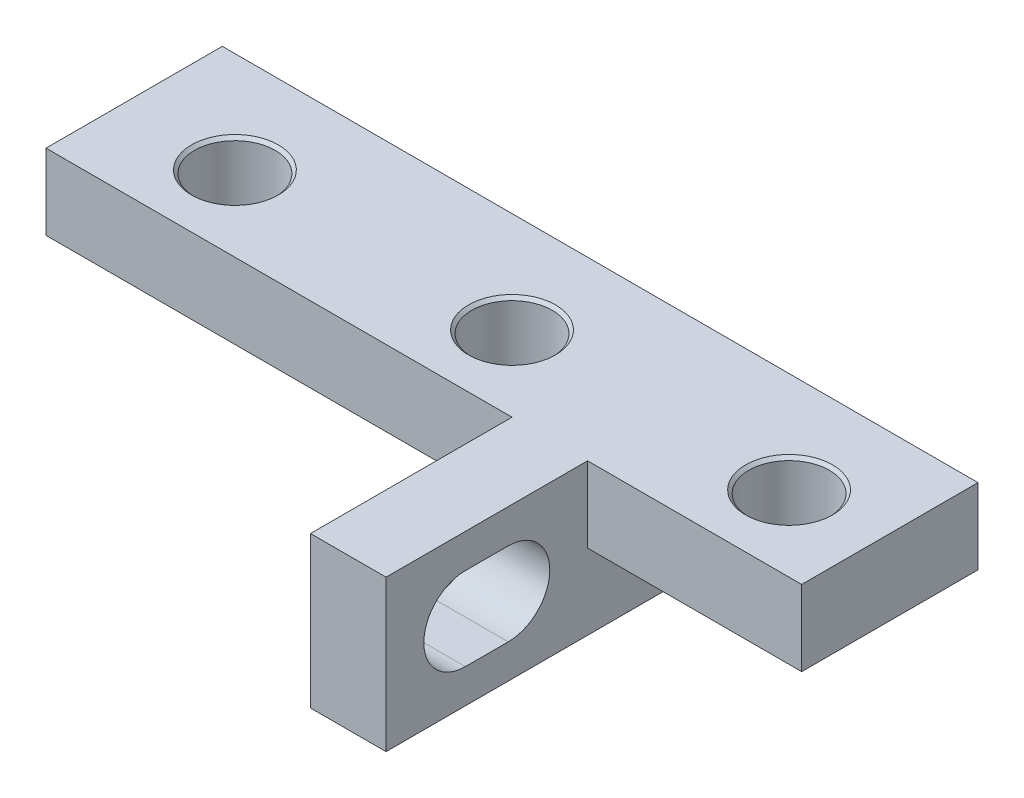
ISO-10303-21;
HEADER;
FILE_DESCRIPTION(('STEP AP214'),'2;1');
FILE_NAME('part.step','',(''),(''),'','','');
FILE_SCHEMA(('AUTOMOTIVE_DESIGN { 1 0 10303 214 1 1 1 1 }'));
ENDSEC;
DATA;
#1=APPLICATION_CONTEXT('core data for automotive mechanical design processes');
#2=APPLICATION_PROTOCOL_DEFINITION('international standard','automotive_design',2000,#1);
#3=PRODUCT_CONTEXT('',#1,'mechanical');
#4=PRODUCT('Part','Part','',(#3));
#5=PRODUCT_RELATED_PRODUCT_CATEGORY('part','',(#4));
#6=PRODUCT_DEFINITION_FORMATION('','',#4);
#7=PRODUCT_DEFINITION_CONTEXT('part definition',#1,'design');
#8=PRODUCT_DEFINITION('design','',#6,#7);
#9=PRODUCT_DEFINITION_SHAPE('','',#8);
#10=(LENGTH_UNIT() NAMED_UNIT(*) SI_UNIT(.MILLI.,.METRE.));
#11=(NAMED_UNIT(*) PLANE_ANGLE_UNIT() SI_UNIT($,.RADIAN.));
#12=(NAMED_UNIT(*) SI_UNIT($,.STERADIAN.) SOLID_ANGLE_UNIT());
#13=UNCERTAINTY_MEASURE_WITH_UNIT(LENGTH_MEASURE(1.E-05),#10,'distance_accuracy_value','');
#14=(GEOMETRIC_REPRESENTATION_CONTEXT(3) GLOBAL_UNCERTAINTY_ASSIGNED_CONTEXT((#13)) GLOBAL_UNIT_ASSIGNED_CONTEXT((#10,
#11,#12)) REPRESENTATION_CONTEXT('',''));
#15=CARTESIAN_POINT('',(0.,0.,0.));
#16=DIRECTION('',(0.,0.,1.));
#17=DIRECTION('',(1.,0.,0.));
#18=AXIS2_PLACEMENT_3D('',#15,#16,#17);
#19=CARTESIAN_POINT('',(-1.5,0.,15.));
#20=DIRECTION('',(0.,0.,-1.));
#21=DIRECTION('',(-1.,0.,0.));
#22=AXIS2_PLACEMENT_3D('',#19,#20,#21);
#23=PLANE('',#22);
#24=DIRECTION('',(0.,1.,0.));
#25=VECTOR('',#24,1.);
#26=CARTESIAN_POINT('',(1.5,22.,15.));
#27=LINE('',#26,#25);
#28=CARTESIAN_POINT('',(1.5,19.,15.));
#29=VERTEX_POINT('',#28);
#30=CARTESIAN_POINT('',(1.5,25.,15.));
#31=VERTEX_POINT('',#30);
#32=EDGE_CURVE('E249',#29,#31,#27,.T.);
#33=ORIENTED_EDGE('',*,*,#32,.T.);
#34=DIRECTION('',(-1.,0.,0.));
#35=VECTOR('',#34,1.);
#36=CARTESIAN_POINT('',(-20.,25.,15.));
#37=LINE('',#36,#35);
#38=CARTESIAN_POINT('',(-1.5,25.,15.));
#39=VERTEX_POINT('',#38);
#40=EDGE_CURVE('E251',#31,#39,#37,.T.);
#41=ORIENTED_EDGE('',*,*,#40,.T.);
#42=DIRECTION('',(0.,-1.,0.));
#43=VECTOR('',#42,1.);
#44=CARTESIAN_POINT('',(-1.5,0.,15.));
#45=LINE('',#44,#43);
#46=CARTESIAN_POINT('',(-1.5,19.,15.));
#47=VERTEX_POINT('',#46);
#48=EDGE_CURVE('E254',#39,#47,#45,.T.);
#49=ORIENTED_EDGE('',*,*,#48,.T.);
#50=DIRECTION('',(1.,0.,0.));
#51=VECTOR('',#50,1.);
#52=CARTESIAN_POINT('',(-2.24646963588495,19.,15.));
#53=LINE('',#52,#51);
#54=EDGE_CURVE('E236',#47,#29,#53,.T.);
#55=ORIENTED_EDGE('',*,*,#54,.T.);
#56=EDGE_LOOP('',(#33,#41,#49,#55));
#57=FACE_BOUND('',#56,.T.);
#58=ADVANCED_FACE('F34',(#57),#23,.F.);
#59=CARTESIAN_POINT('',(-1.5,0.,0.));
#60=DIRECTION('',(0.,0.,-1.));
#61=DIRECTION('',(-1.,0.,0.));
#62=AXIS2_PLACEMENT_3D('',#59,#60,#61);
#63=PLANE('',#62);
#64=DIRECTION('',(-1.,0.,0.));
#65=VECTOR('',#64,1.);
#66=CARTESIAN_POINT('',(-20.,25.,0.));
#67=LINE('',#66,#65);
#68=CARTESIAN_POINT('',(10.,25.,0.));
#69=VERTEX_POINT('',#68);
#70=CARTESIAN_POINT('',(-20.,25.,0.));
#71=VERTEX_POINT('',#70);
#72=EDGE_CURVE('E263',#69,#71,#67,.T.);
#73=ORIENTED_EDGE('',*,*,#72,.F.);
#74=DIRECTION('',(0.,1.,0.));
#75=VECTOR('',#74,1.);
#76=CARTESIAN_POINT('',(10.,-16.231303942556,0.));
#77=LINE('',#76,#75);
#78=CARTESIAN_POINT('',(10.,22.,0.));
#79=VERTEX_POINT('',#78);
#80=EDGE_CURVE('E224',#79,#69,#77,.T.);
#81=ORIENTED_EDGE('',*,*,#80,.F.);
#82=DIRECTION('',(1.,0.,0.));
#83=VECTOR('',#82,1.);
#84=CARTESIAN_POINT('',(20.,22.,0.));
#85=LINE('',#84,#83);
#86=CARTESIAN_POINT('',(1.5,22.,0.));
#87=VERTEX_POINT('',#86);
#88=EDGE_CURVE('E260',#87,#79,#85,.T.);
#89=ORIENTED_EDGE('',*,*,#88,.F.);
#90=DIRECTION('',(0.,1.,0.));
#91=VECTOR('',#90,1.);
#92=CARTESIAN_POINT('',(1.5,22.,0.));
#93=LINE('',#92,#91);
#94=CARTESIAN_POINT('',(1.5,19.,0.));
#95=VERTEX_POINT('',#94);
#96=EDGE_CURVE('E246',#95,#87,#93,.T.);
#97=ORIENTED_EDGE('',*,*,#96,.F.);
#98=DIRECTION('',(1.,0.,0.));
#99=VECTOR('',#98,1.);
#100=CARTESIAN_POINT('',(-2.24646963588495,19.,0.));
#101=LINE('',#100,#99);
#102=CARTESIAN_POINT('',(-1.5,19.,0.));
#103=VERTEX_POINT('',#102);
#104=EDGE_CURVE('E239',#103,#95,#101,.T.);
#105=ORIENTED_EDGE('',*,*,#104,.F.);
#106=DIRECTION('',(0.,-1.,0.));
#107=VECTOR('',#106,1.);
#108=CARTESIAN_POINT('',(-1.5,0.,0.));
#109=LINE('',#108,#107);
#110=CARTESIAN_POINT('',(-1.5,22.,0.));
#111=VERTEX_POINT('',#110);
#112=EDGE_CURVE('E252',#111,#103,#109,.T.);
#113=ORIENTED_EDGE('',*,*,#112,.F.);
#114=DIRECTION('',(1.,0.,0.));
#115=VECTOR('',#114,1.);
#116=CARTESIAN_POINT('',(-1.5,22.,0.));
#117=LINE('',#116,#115);
#118=CARTESIAN_POINT('',(-20.,22.,0.));
#119=VERTEX_POINT('',#118);
#120=EDGE_CURVE('E269',#119,#111,#117,.T.);
#121=ORIENTED_EDGE('',*,*,#120,.F.);
#122=DIRECTION('',(0.,-1.,0.));
#123=VECTOR('',#122,1.);
#124=CARTESIAN_POINT('',(-20.,22.,0.));
#125=LINE('',#124,#123);
#126=EDGE_CURVE('E266',#71,#119,#125,.T.);
#127=ORIENTED_EDGE('',*,*,#126,.F.);
#128=EDGE_LOOP('',(#73,#81,#89,#97,#105,#113,#121,#127));
#129=FACE_BOUND('',#128,.T.);
#130=ADVANCED_FACE('F292',(#129),#63,.T.);
#131=CARTESIAN_POINT('',(20.,22.,15.));
#132=DIRECTION('',(0.,1.,0.));
#133=DIRECTION('',(-1.,0.,0.));
#134=AXIS2_PLACEMENT_3D('',#131,#132,#133);
#135=PLANE('',#134);
#136=CARTESIAN_POINT('',(6.5,22.,4.));
#137=DIRECTION('',(0.,-1.,0.));
#138=DIRECTION('',(0.,0.,-1.));
#139=AXIS2_PLACEMENT_3D('',#136,#137,#138);
#140=CIRCLE('',#139,1.725);
#141=CARTESIAN_POINT('',(6.5,22.,2.275));
#142=VERTEX_POINT('',#141);
#143=EDGE_CURVE('E185',#142,#142,#140,.T.);
#144=ORIENTED_EDGE('',*,*,#143,.F.);
#145=EDGE_LOOP('',(#144));
#146=FACE_BOUND('',#145,.T.);
#147=DIRECTION('',(0.,0.,1.));
#148=VECTOR('',#147,1.);
#149=CARTESIAN_POINT('',(10.,22.,0.));
#150=LINE('',#149,#148);
#151=CARTESIAN_POINT('',(10.,22.,7.));
#152=VERTEX_POINT('',#151);
#153=EDGE_CURVE('E232',#79,#152,#150,.T.);
#154=ORIENTED_EDGE('',*,*,#153,.T.);
#155=DIRECTION('',(1.,0.,0.));
#156=VECTOR('',#155,1.);
#157=CARTESIAN_POINT('',(-5.,22.,7.));
#158=LINE('',#157,#156);
#159=CARTESIAN_POINT('',(1.5,22.,7.));
#160=VERTEX_POINT('',#159);
#161=EDGE_CURVE('E207',#160,#152,#158,.T.);
#162=ORIENTED_EDGE('',*,*,#161,.F.);
#163=DIRECTION('',(0.,0.,-1.));
#164=VECTOR('',#163,1.);
#165=CARTESIAN_POINT('',(1.5,22.,15.));
#166=LINE('',#165,#164);
#167=EDGE_CURVE('E12',#160,#87,#166,.T.);
#168=ORIENTED_EDGE('',*,*,#167,.T.);
#169=ORIENTED_EDGE('',*,*,#88,.T.);
#170=EDGE_LOOP('',(#154,#162,#168,#169));
#171=FACE_BOUND('',#170,.T.);
#172=ADVANCED_FACE('F318',(#146,#171),#135,.F.);
#173=CARTESIAN_POINT('',(-20.,25.,15.));
#174=DIRECTION('',(0.,-1.,0.));
#175=DIRECTION('',(0.,0.,-1.));
#176=AXIS2_PLACEMENT_3D('',#173,#174,#175);
#177=PLANE('',#176);
#178=CARTESIAN_POINT('',(-15.5,25.,4.));
#179=DIRECTION('',(0.,-1.,0.));
#180=DIRECTION('',(0.,0.,-1.));
#181=AXIS2_PLACEMENT_3D('',#178,#179,#180);
#182=CIRCLE('',#181,1.725);
#183=CARTESIAN_POINT('',(-15.5,25.,2.275));
#184=VERTEX_POINT('',#183);
#185=EDGE_CURVE('E148',#184,#184,#182,.T.);
#186=ORIENTED_EDGE('',*,*,#185,.T.);
#187=EDGE_LOOP('',(#186));
#188=FACE_BOUND('',#187,.T.);
#189=CARTESIAN_POINT('',(6.5,25.,4.));
#190=DIRECTION('',(0.,-1.,0.));
#191=DIRECTION('',(0.,0.,-1.));
#192=AXIS2_PLACEMENT_3D('',#189,#190,#191);
#193=CIRCLE('',#192,1.725);
#194=CARTESIAN_POINT('',(6.5,25.,2.275));
#195=VERTEX_POINT('',#194);
#196=EDGE_CURVE('E182',#195,#195,#193,.T.);
#197=ORIENTED_EDGE('',*,*,#196,.T.);
#198=EDGE_LOOP('',(#197));
#199=FACE_BOUND('',#198,.T.);
#200=CARTESIAN_POINT('',(-4.5,25.,4.));
#201=DIRECTION('',(0.,-1.,0.));
#202=DIRECTION('',(0.,0.,-1.));
#203=AXIS2_PLACEMENT_3D('',#200,#201,#202);
#204=CIRCLE('',#203,1.725);
#205=CARTESIAN_POINT('',(-4.5,25.,2.275));
#206=VERTEX_POINT('',#205);
#207=EDGE_CURVE('E194',#206,#206,#204,.T.);
#208=ORIENTED_EDGE('',*,*,#207,.T.);
#209=EDGE_LOOP('',(#208));
#210=FACE_BOUND('',#209,.T.);
#211=DIRECTION('',(0.,0.,1.));
#212=VECTOR('',#211,1.);
#213=CARTESIAN_POINT('',(1.5,25.,-18.7416648139913));
#214=LINE('',#213,#212);
#215=CARTESIAN_POINT('',(1.5,25.,7.));
#216=VERTEX_POINT('',#215);
#217=EDGE_CURVE('E214',#216,#31,#214,.T.);
#218=ORIENTED_EDGE('',*,*,#217,.F.);
#219=DIRECTION('',(-1.,0.,0.));
#220=VECTOR('',#219,1.);
#221=CARTESIAN_POINT('',(-5.,25.,7.));
#222=LINE('',#221,#220);
#223=CARTESIAN_POINT('',(10.,25.,7.));
#224=VERTEX_POINT('',#223);
#225=EDGE_CURVE('E211',#224,#216,#222,.T.);
#226=ORIENTED_EDGE('',*,*,#225,.F.);
#227=DIRECTION('',(0.,0.,1.));
#228=VECTOR('',#227,1.);
#229=CARTESIAN_POINT('',(10.,25.,0.));
#230=LINE('',#229,#228);
#231=EDGE_CURVE('E233',#69,#224,#230,.T.);
#232=ORIENTED_EDGE('',*,*,#231,.F.);
#233=ORIENTED_EDGE('',*,*,#72,.T.);
#234=DIRECTION('',(0.,0.,-1.));
#235=VECTOR('',#234,1.);
#236=CARTESIAN_POINT('',(-20.,25.,15.));
#237=LINE('',#236,#235);
#238=CARTESIAN_POINT('',(-20.,25.,7.));
#239=VERTEX_POINT('',#238);
#240=EDGE_CURVE('E42',#239,#71,#237,.T.);
#241=ORIENTED_EDGE('',*,*,#240,.F.);
#242=DIRECTION('',(-1.,0.,0.));
#243=VECTOR('',#242,1.);
#244=CARTESIAN_POINT('',(-5.,25.,7.));
#245=LINE('',#244,#243);
#246=CARTESIAN_POINT('',(-1.5,25.,7.));
#247=VERTEX_POINT('',#246);
#248=EDGE_CURVE('E227',#247,#239,#245,.T.);
#249=ORIENTED_EDGE('',*,*,#248,.F.);
#250=DIRECTION('',(0.,0.,1.));
#251=VECTOR('',#250,1.);
#252=CARTESIAN_POINT('',(-1.5,25.,-18.7416648139913));
#253=LINE('',#252,#251);
#254=EDGE_CURVE('E221',#247,#39,#253,.T.);
#255=ORIENTED_EDGE('',*,*,#254,.T.);
#256=ORIENTED_EDGE('',*,*,#40,.F.);
#257=EDGE_LOOP('',(#218,#226,#232,#233,#241,#249,#255,#256));
#258=FACE_BOUND('',#257,.T.);
#259=ADVANCED_FACE('F288',(#188,#199,#210,#258),#177,.F.);
#260=CARTESIAN_POINT('',(1.5,22.,15.));
#261=DIRECTION('',(-1.,0.,0.));
#262=DIRECTION('',(0.,-1.,0.));
#263=AXIS2_PLACEMENT_3D('',#260,#261,#262);
#264=PLANE('',#263);
#265=DIRECTION('',(0.,0.,-1.));
#266=VECTOR('',#265,1.);
#267=CARTESIAN_POINT('',(1.5,20.35,11.85));
#268=LINE('',#267,#266);
#269=CARTESIAN_POINT('',(1.5,20.35,11.85));
#270=VERTEX_POINT('',#269);
#271=CARTESIAN_POINT('',(1.5,20.35,10.15));
#272=VERTEX_POINT('',#271);
#273=EDGE_CURVE('E156',#270,#272,#268,.T.);
#274=ORIENTED_EDGE('',*,*,#273,.F.);
#275=CARTESIAN_POINT('',(1.5,22.,11.85));
#276=DIRECTION('',(1.,0.,0.));
#277=DIRECTION('',(0.,1.,0.));
#278=AXIS2_PLACEMENT_3D('',#275,#276,#277);
#279=CIRCLE('',#278,1.65);
#280=CARTESIAN_POINT('',(1.5,23.65,11.85));
#281=VERTEX_POINT('',#280);
#282=EDGE_CURVE('E49',#281,#270,#279,.T.);
#283=ORIENTED_EDGE('',*,*,#282,.F.);
#284=DIRECTION('',(0.,0.,1.));
#285=VECTOR('',#284,1.);
#286=CARTESIAN_POINT('',(1.5,23.65,11.85));
#287=LINE('',#286,#285);
#288=CARTESIAN_POINT('',(1.5,23.65,10.15));
#289=VERTEX_POINT('',#288);
#290=EDGE_CURVE('E142',#289,#281,#287,.T.);
#291=ORIENTED_EDGE('',*,*,#290,.F.);
#292=CARTESIAN_POINT('',(1.5,22.,10.15));
#293=DIRECTION('',(1.,0.,0.));
#294=DIRECTION('',(0.,1.,0.));
#295=AXIS2_PLACEMENT_3D('',#292,#293,#294);
#296=CIRCLE('',#295,1.65);
#297=EDGE_CURVE('E162',#272,#289,#296,.T.);
#298=ORIENTED_EDGE('',*,*,#297,.F.);
#299=EDGE_LOOP('',(#274,#283,#291,#298));
#300=FACE_BOUND('',#299,.T.);
#301=DIRECTION('',(0.,0.,1.));
#302=VECTOR('',#301,1.);
#303=CARTESIAN_POINT('',(1.5,19.,0.));
#304=LINE('',#303,#302);
#305=EDGE_CURVE('E244',#95,#29,#304,.T.);
#306=ORIENTED_EDGE('',*,*,#305,.F.);
#307=ORIENTED_EDGE('',*,*,#96,.T.);
#308=ORIENTED_EDGE('',*,*,#167,.F.);
#309=DIRECTION('',(0.,1.,0.));
#310=VECTOR('',#309,1.);
#311=CARTESIAN_POINT('',(1.5,-1.93805977429964,7.));
#312=LINE('',#311,#310);
#313=EDGE_CURVE('E206',#160,#216,#312,.T.);
#314=ORIENTED_EDGE('',*,*,#313,.T.);
#315=ORIENTED_EDGE('',*,*,#217,.T.);
#316=ORIENTED_EDGE('',*,*,#32,.F.);
#317=EDGE_LOOP('',(#306,#307,#308,#314,#315,#316));
#318=FACE_BOUND('',#317,.T.);
#319=ADVANCED_FACE('F36',(#300,#318),#264,.F.);
#320=CARTESIAN_POINT('',(-1.5,0.,15.));
#321=DIRECTION('',(1.,0.,0.));
#322=DIRECTION('',(0.,1.,0.));
#323=AXIS2_PLACEMENT_3D('',#320,#321,#322);
#324=PLANE('',#323);
#325=DIRECTION('',(0.,0.,-1.));
#326=VECTOR('',#325,1.);
#327=CARTESIAN_POINT('',(-1.5,23.65,11.85));
#328=LINE('',#327,#326);
#329=CARTESIAN_POINT('',(-1.5,23.65,11.85));
#330=VERTEX_POINT('',#329);
#331=CARTESIAN_POINT('',(-1.5,23.65,10.15));
#332=VERTEX_POINT('',#331);
#333=EDGE_CURVE('E154',#330,#332,#328,.T.);
#334=ORIENTED_EDGE('',*,*,#333,.F.);
#335=CARTESIAN_POINT('',(-1.5,22.,11.85));
#336=DIRECTION('',(1.,0.,0.));
#337=DIRECTION('',(0.,1.,0.));
#338=AXIS2_PLACEMENT_3D('',#335,#336,#337);
#339=CIRCLE('',#338,1.65);
#340=CARTESIAN_POINT('',(-1.5,20.35,11.85));
#341=VERTEX_POINT('',#340);
#342=EDGE_CURVE('E136',#341,#330,#339,.F.);
#343=ORIENTED_EDGE('',*,*,#342,.F.);
#344=DIRECTION('',(0.,0.,1.));
#345=VECTOR('',#344,1.);
#346=CARTESIAN_POINT('',(-1.5,20.35,11.85));
#347=LINE('',#346,#345);
#348=CARTESIAN_POINT('',(-1.5,20.35,10.15));
#349=VERTEX_POINT('',#348);
#350=EDGE_CURVE('E145',#349,#341,#347,.T.);
#351=ORIENTED_EDGE('',*,*,#350,.F.);
#352=CARTESIAN_POINT('',(-1.5,22.,10.15));
#353=DIRECTION('',(1.,0.,0.));
#354=DIRECTION('',(0.,1.,0.));
#355=AXIS2_PLACEMENT_3D('',#352,#353,#354);
#356=CIRCLE('',#355,1.65);
#357=EDGE_CURVE('E57',#332,#349,#356,.F.);
#358=ORIENTED_EDGE('',*,*,#357,.F.);
#359=EDGE_LOOP('',(#334,#343,#351,#358));
#360=FACE_BOUND('',#359,.T.);
#361=DIRECTION('',(0.,0.,1.));
#362=VECTOR('',#361,1.);
#363=CARTESIAN_POINT('',(-1.5,19.,0.));
#364=LINE('',#363,#362);
#365=EDGE_CURVE('E241',#103,#47,#364,.T.);
#366=ORIENTED_EDGE('',*,*,#365,.T.);
#367=ORIENTED_EDGE('',*,*,#48,.F.);
#368=ORIENTED_EDGE('',*,*,#254,.F.);
#369=DIRECTION('',(0.,1.,0.));
#370=VECTOR('',#369,1.);
#371=CARTESIAN_POINT('',(-1.5,-1.93805977429964,7.));
#372=LINE('',#371,#370);
#373=CARTESIAN_POINT('',(-1.5,22.,7.));
#374=VERTEX_POINT('',#373);
#375=EDGE_CURVE('E218',#374,#247,#372,.T.);
#376=ORIENTED_EDGE('',*,*,#375,.F.);
#377=DIRECTION('',(0.,0.,-1.));
#378=VECTOR('',#377,1.);
#379=CARTESIAN_POINT('',(-1.5,22.,15.));
#380=LINE('',#379,#378);
#381=EDGE_CURVE('E257',#374,#111,#380,.T.);
#382=ORIENTED_EDGE('',*,*,#381,.T.);
#383=ORIENTED_EDGE('',*,*,#112,.T.);
#384=EDGE_LOOP('',(#366,#367,#368,#376,#382,#383));
#385=FACE_BOUND('',#384,.T.);
#386=ADVANCED_FACE('F151',(#360,#385),#324,.F.);
#387=CARTESIAN_POINT('',(-20.,22.,15.));
#388=DIRECTION('',(1.,0.,0.));
#389=DIRECTION('',(0.,0.,-1.));
#390=AXIS2_PLACEMENT_3D('',#387,#388,#389);
#391=PLANE('',#390);
#392=DIRECTION('',(0.,0.,-1.));
#393=VECTOR('',#392,1.);
#394=CARTESIAN_POINT('',(-20.,22.,15.));
#395=LINE('',#394,#393);
#396=CARTESIAN_POINT('',(-20.,22.,7.));
#397=VERTEX_POINT('',#396);
#398=EDGE_CURVE('E275',#397,#119,#395,.T.);
#399=ORIENTED_EDGE('',*,*,#398,.F.);
#400=DIRECTION('',(0.,-1.,0.));
#401=VECTOR('',#400,1.);
#402=CARTESIAN_POINT('',(-20.,-1.93805977429964,7.));
#403=LINE('',#402,#401);
#404=EDGE_CURVE('E225',#239,#397,#403,.T.);
#405=ORIENTED_EDGE('',*,*,#404,.F.);
#406=ORIENTED_EDGE('',*,*,#240,.T.);
#407=ORIENTED_EDGE('',*,*,#126,.T.);
#408=EDGE_LOOP('',(#399,#405,#406,#407));
#409=FACE_BOUND('',#408,.T.);
#410=ADVANCED_FACE('F280',(#409),#391,.F.);
#411=CARTESIAN_POINT('',(-1.5,22.,15.));
#412=DIRECTION('',(0.,1.,0.));
#413=DIRECTION('',(-1.,0.,0.));
#414=AXIS2_PLACEMENT_3D('',#411,#412,#413);
#415=PLANE('',#414);
#416=CARTESIAN_POINT('',(-15.5,22.,4.));
#417=DIRECTION('',(0.,-1.,0.));
#418=DIRECTION('',(0.,0.,-1.));
#419=AXIS2_PLACEMENT_3D('',#416,#417,#418);
#420=CIRCLE('',#419,1.725);
#421=CARTESIAN_POINT('',(-15.5,22.,2.275));
#422=VERTEX_POINT('',#421);
#423=EDGE_CURVE('E173',#422,#422,#420,.T.);
#424=ORIENTED_EDGE('',*,*,#423,.F.);
#425=EDGE_LOOP('',(#424));
#426=FACE_BOUND('',#425,.T.);
#427=CARTESIAN_POINT('',(-4.5,22.,4.));
#428=DIRECTION('',(0.,-1.,0.));
#429=DIRECTION('',(0.,0.,-1.));
#430=AXIS2_PLACEMENT_3D('',#427,#428,#429);
#431=CIRCLE('',#430,1.725);
#432=CARTESIAN_POINT('',(-4.5,22.,2.275));
#433=VERTEX_POINT('',#432);
#434=EDGE_CURVE('E197',#433,#433,#431,.T.);
#435=ORIENTED_EDGE('',*,*,#434,.F.);
#436=EDGE_LOOP('',(#435));
#437=FACE_BOUND('',#436,.T.);
#438=ORIENTED_EDGE('',*,*,#381,.F.);
#439=DIRECTION('',(1.,0.,0.));
#440=VECTOR('',#439,1.);
#441=CARTESIAN_POINT('',(-5.,22.,7.));
#442=LINE('',#441,#440);
#443=EDGE_CURVE('E222',#397,#374,#442,.T.);
#444=ORIENTED_EDGE('',*,*,#443,.F.);
#445=ORIENTED_EDGE('',*,*,#398,.T.);
#446=ORIENTED_EDGE('',*,*,#120,.T.);
#447=EDGE_LOOP('',(#438,#444,#445,#446));
#448=FACE_BOUND('',#447,.T.);
#449=ADVANCED_FACE('F297',(#426,#437,#448),#415,.F.);
#450=CARTESIAN_POINT('',(-2.24646963588495,19.,0.));
#451=DIRECTION('',(0.,-1.,0.));
#452=DIRECTION('',(0.,0.,-1.));
#453=AXIS2_PLACEMENT_3D('',#450,#451,#452);
#454=PLANE('',#453);
#455=ORIENTED_EDGE('',*,*,#54,.F.);
#456=ORIENTED_EDGE('',*,*,#365,.F.);
#457=ORIENTED_EDGE('',*,*,#104,.T.);
#458=ORIENTED_EDGE('',*,*,#305,.T.);
#459=EDGE_LOOP('',(#455,#456,#457,#458));
#460=FACE_BOUND('',#459,.T.);
#461=ADVANCED_FACE('F320',(#460),#454,.T.);
#462=CARTESIAN_POINT('',(10.,-16.231303942556,0.));
#463=DIRECTION('',(1.,0.,0.));
#464=DIRECTION('',(0.,0.,-1.));
#465=AXIS2_PLACEMENT_3D('',#462,#463,#464);
#466=PLANE('',#465);
#467=DIRECTION('',(0.,1.,0.));
#468=VECTOR('',#467,1.);
#469=CARTESIAN_POINT('',(10.,-1.93805977429964,7.));
#470=LINE('',#469,#468);
#471=EDGE_CURVE('E209',#152,#224,#470,.T.);
#472=ORIENTED_EDGE('',*,*,#471,.F.);
#473=ORIENTED_EDGE('',*,*,#153,.F.);
#474=ORIENTED_EDGE('',*,*,#80,.T.);
#475=ORIENTED_EDGE('',*,*,#231,.T.);
#476=EDGE_LOOP('',(#472,#473,#474,#475));
#477=FACE_BOUND('',#476,.T.);
#478=ADVANCED_FACE('F314',(#477),#466,.T.);
#479=CARTESIAN_POINT('',(-1.5,0.,7.));
#480=DIRECTION('',(0.,0.,-1.));
#481=DIRECTION('',(-1.,0.,0.));
#482=AXIS2_PLACEMENT_3D('',#479,#480,#481);
#483=PLANE('',#482);
#484=ORIENTED_EDGE('',*,*,#443,.T.);
#485=ORIENTED_EDGE('',*,*,#375,.T.);
#486=ORIENTED_EDGE('',*,*,#248,.T.);
#487=ORIENTED_EDGE('',*,*,#404,.T.);
#488=EDGE_LOOP('',(#484,#485,#486,#487));
#489=FACE_BOUND('',#488,.T.);
#490=ADVANCED_FACE('F301',(#489),#483,.F.);
#491=CARTESIAN_POINT('',(-1.5,0.,7.));
#492=DIRECTION('',(0.,0.,-1.));
#493=DIRECTION('',(-1.,0.,0.));
#494=AXIS2_PLACEMENT_3D('',#491,#492,#493);
#495=PLANE('',#494);
#496=ORIENTED_EDGE('',*,*,#161,.T.);
#497=ORIENTED_EDGE('',*,*,#471,.T.);
#498=ORIENTED_EDGE('',*,*,#225,.T.);
#499=ORIENTED_EDGE('',*,*,#313,.F.);
#500=EDGE_LOOP('',(#496,#497,#498,#499));
#501=FACE_BOUND('',#500,.T.);
#502=ADVANCED_FACE('F311',(#501),#495,.F.);
#503=CARTESIAN_POINT('',(-4.5,24.875,4.));
#504=DIRECTION('',(0.,1.,0.));
#505=DIRECTION('',(0.,0.,1.));
#506=AXIS2_PLACEMENT_3D('',#503,#504,#505);
#507=CONICAL_SURFACE('',#506,1.6,0.785398163397448);
#508=ORIENTED_EDGE('',*,*,#207,.F.);
#509=EDGE_LOOP('',(#508));
#510=FACE_BOUND('',#509,.T.);
#511=CARTESIAN_POINT('',(-4.5,24.875,4.));
#512=DIRECTION('',(0.,-1.,0.));
#513=DIRECTION('',(0.,0.,-1.));
#514=AXIS2_PLACEMENT_3D('',#511,#512,#513);
#515=CIRCLE('',#514,1.6);
#516=CARTESIAN_POINT('',(-4.5,24.875,2.4));
#517=VERTEX_POINT('',#516);
#518=EDGE_CURVE('E203',#517,#517,#515,.T.);
#519=ORIENTED_EDGE('',*,*,#518,.T.);
#520=EDGE_LOOP('',(#519));
#521=FACE_BOUND('',#520,.T.);
#522=ADVANCED_FACE('F378',(#510,#521),#507,.F.);
#523=CARTESIAN_POINT('',(-4.5,22.,4.));
#524=DIRECTION('',(0.,-1.,0.));
#525=DIRECTION('',(0.,0.,-1.));
#526=AXIS2_PLACEMENT_3D('',#523,#524,#525);
#527=CYLINDRICAL_SURFACE('',#526,1.6);
#528=ORIENTED_EDGE('',*,*,#518,.F.);
#529=EDGE_LOOP('',(#528));
#530=FACE_BOUND('',#529,.T.);
#531=CARTESIAN_POINT('',(-4.5,22.125,4.));
#532=DIRECTION('',(0.,-1.,0.));
#533=DIRECTION('',(0.,0.,-1.));
#534=AXIS2_PLACEMENT_3D('',#531,#532,#533);
#535=CIRCLE('',#534,1.6);
#536=CARTESIAN_POINT('',(-4.5,22.125,2.4));
#537=VERTEX_POINT('',#536);
#538=EDGE_CURVE('E200',#537,#537,#535,.T.);
#539=ORIENTED_EDGE('',*,*,#538,.T.);
#540=EDGE_LOOP('',(#539));
#541=FACE_BOUND('',#540,.T.);
#542=ADVANCED_FACE('F374',(#530,#541),#527,.F.);
#543=CARTESIAN_POINT('',(-4.5,22.,4.));
#544=DIRECTION('',(0.,-1.,0.));
#545=DIRECTION('',(0.,0.,-1.));
#546=AXIS2_PLACEMENT_3D('',#543,#544,#545);
#547=CONICAL_SURFACE('',#546,1.725,0.785398163397438);
#548=ORIENTED_EDGE('',*,*,#538,.F.);
#549=EDGE_LOOP('',(#548));
#550=FACE_BOUND('',#549,.T.);
#551=ORIENTED_EDGE('',*,*,#434,.T.);
#552=EDGE_LOOP('',(#551));
#553=FACE_BOUND('',#552,.T.);
#554=ADVANCED_FACE('F370',(#550,#553),#547,.F.);
#555=CARTESIAN_POINT('',(6.5,24.875,4.));
#556=DIRECTION('',(0.,1.,0.));
#557=DIRECTION('',(0.,0.,1.));
#558=AXIS2_PLACEMENT_3D('',#555,#556,#557);
#559=CONICAL_SURFACE('',#558,1.6,0.785398163397448);
#560=ORIENTED_EDGE('',*,*,#196,.F.);
#561=EDGE_LOOP('',(#560));
#562=FACE_BOUND('',#561,.T.);
#563=CARTESIAN_POINT('',(6.5,24.875,4.));
#564=DIRECTION('',(0.,-1.,0.));
#565=DIRECTION('',(0.,0.,-1.));
#566=AXIS2_PLACEMENT_3D('',#563,#564,#565);
#567=CIRCLE('',#566,1.6);
#568=CARTESIAN_POINT('',(6.5,24.875,2.4));
#569=VERTEX_POINT('',#568);
#570=EDGE_CURVE('E191',#569,#569,#567,.T.);
#571=ORIENTED_EDGE('',*,*,#570,.T.);
#572=EDGE_LOOP('',(#571));
#573=FACE_BOUND('',#572,.T.);
#574=ADVANCED_FACE('F362',(#562,#573),#559,.F.);
#575=CARTESIAN_POINT('',(6.5,22.,4.));
#576=DIRECTION('',(0.,-1.,0.));
#577=DIRECTION('',(0.,0.,-1.));
#578=AXIS2_PLACEMENT_3D('',#575,#576,#577);
#579=CYLINDRICAL_SURFACE('',#578,1.6);
#580=ORIENTED_EDGE('',*,*,#570,.F.);
#581=EDGE_LOOP('',(#580));
#582=FACE_BOUND('',#581,.T.);
#583=CARTESIAN_POINT('',(6.5,22.125,4.));
#584=DIRECTION('',(0.,-1.,0.));
#585=DIRECTION('',(0.,0.,-1.));
#586=AXIS2_PLACEMENT_3D('',#583,#584,#585);
#587=CIRCLE('',#586,1.6);
#588=CARTESIAN_POINT('',(6.5,22.125,2.4));
#589=VERTEX_POINT('',#588);
#590=EDGE_CURVE('E188',#589,#589,#587,.T.);
#591=ORIENTED_EDGE('',*,*,#590,.T.);
#592=EDGE_LOOP('',(#591));
#593=FACE_BOUND('',#592,.T.);
#594=ADVANCED_FACE('F352',(#582,#593),#579,.F.);
#595=CARTESIAN_POINT('',(6.5,22.,4.));
#596=DIRECTION('',(0.,-1.,0.));
#597=DIRECTION('',(0.,0.,-1.));
#598=AXIS2_PLACEMENT_3D('',#595,#596,#597);
#599=CONICAL_SURFACE('',#598,1.725,0.785398163397441);
#600=ORIENTED_EDGE('',*,*,#590,.F.);
#601=EDGE_LOOP('',(#600));
#602=FACE_BOUND('',#601,.T.);
#603=ORIENTED_EDGE('',*,*,#143,.T.);
#604=EDGE_LOOP('',(#603));
#605=FACE_BOUND('',#604,.T.);
#606=ADVANCED_FACE('F349',(#602,#605),#599,.F.);
#607=CARTESIAN_POINT('',(-15.5,24.875,4.));
#608=DIRECTION('',(0.,1.,0.));
#609=DIRECTION('',(0.,0.,1.));
#610=AXIS2_PLACEMENT_3D('',#607,#608,#609);
#611=CONICAL_SURFACE('',#610,1.6,0.785398163397448);
#612=ORIENTED_EDGE('',*,*,#185,.F.);
#613=EDGE_LOOP('',(#612));
#614=FACE_BOUND('',#613,.T.);
#615=CARTESIAN_POINT('',(-15.5,24.875,4.));
#616=DIRECTION('',(0.,-1.,0.));
#617=DIRECTION('',(0.,0.,-1.));
#618=AXIS2_PLACEMENT_3D('',#615,#616,#617);
#619=CIRCLE('',#618,1.6);
#620=CARTESIAN_POINT('',(-15.5,24.875,2.4));
#621=VERTEX_POINT('',#620);
#622=EDGE_CURVE('E179',#621,#621,#619,.T.);
#623=ORIENTED_EDGE('',*,*,#622,.T.);
#624=EDGE_LOOP('',(#623));
#625=FACE_BOUND('',#624,.T.);
#626=ADVANCED_FACE('F351',(#614,#625),#611,.F.);
#627=CARTESIAN_POINT('',(-15.5,22.,4.));
#628=DIRECTION('',(0.,-1.,0.));
#629=DIRECTION('',(0.,0.,-1.));
#630=AXIS2_PLACEMENT_3D('',#627,#628,#629);
#631=CYLINDRICAL_SURFACE('',#630,1.6);
#632=ORIENTED_EDGE('',*,*,#622,.F.);
#633=EDGE_LOOP('',(#632));
#634=FACE_BOUND('',#633,.T.);
#635=CARTESIAN_POINT('',(-15.5,22.125,4.));
#636=DIRECTION('',(0.,-1.,0.));
#637=DIRECTION('',(0.,0.,-1.));
#638=AXIS2_PLACEMENT_3D('',#635,#636,#637);
#639=CIRCLE('',#638,1.6);
#640=CARTESIAN_POINT('',(-15.5,22.125,2.4));
#641=VERTEX_POINT('',#640);
#642=EDGE_CURVE('E176',#641,#641,#639,.T.);
#643=ORIENTED_EDGE('',*,*,#642,.T.);
#644=EDGE_LOOP('',(#643));
#645=FACE_BOUND('',#644,.T.);
#646=ADVANCED_FACE('F359',(#634,#645),#631,.F.);
#647=CARTESIAN_POINT('',(-15.5,22.,4.));
#648=DIRECTION('',(0.,-1.,0.));
#649=DIRECTION('',(0.,0.,-1.));
#650=AXIS2_PLACEMENT_3D('',#647,#648,#649);
#651=CONICAL_SURFACE('',#650,1.725,0.785398163397448);
#652=ORIENTED_EDGE('',*,*,#642,.F.);
#653=EDGE_LOOP('',(#652));
#654=FACE_BOUND('',#653,.T.);
#655=ORIENTED_EDGE('',*,*,#423,.T.);
#656=EDGE_LOOP('',(#655));
#657=FACE_BOUND('',#656,.T.);
#658=ADVANCED_FACE('F434',(#654,#657),#651,.F.);
#659=CARTESIAN_POINT('',(-20.001,22.,11.85));
#660=DIRECTION('',(1.,0.,0.));
#661=DIRECTION('',(0.,1.,0.));
#662=AXIS2_PLACEMENT_3D('',#659,#660,#661);
#663=CYLINDRICAL_SURFACE('',#662,1.65);
#664=ORIENTED_EDGE('',*,*,#342,.T.);
#665=DIRECTION('',(1.,0.,0.));
#666=VECTOR('',#665,1.);
#667=CARTESIAN_POINT('',(-20.001,23.65,11.85));
#668=LINE('',#667,#666);
#669=EDGE_CURVE('E149',#330,#281,#668,.T.);
#670=ORIENTED_EDGE('',*,*,#669,.T.);
#671=ORIENTED_EDGE('',*,*,#282,.T.);
#672=DIRECTION('',(1.,0.,0.));
#673=VECTOR('',#672,1.);
#674=CARTESIAN_POINT('',(-20.001,20.35,11.85));
#675=LINE('',#674,#673);
#676=EDGE_CURVE('E132',#341,#270,#675,.T.);
#677=ORIENTED_EDGE('',*,*,#676,.F.);
#678=EDGE_LOOP('',(#664,#670,#671,#677));
#679=FACE_BOUND('',#678,.T.);
#680=ADVANCED_FACE('F134',(#679),#663,.F.);
#681=CARTESIAN_POINT('',(-20.001,23.65,11.85));
#682=DIRECTION('',(0.,1.,0.));
#683=DIRECTION('',(-1.,0.,0.));
#684=AXIS2_PLACEMENT_3D('',#681,#682,#683);
#685=PLANE('',#684);
#686=ORIENTED_EDGE('',*,*,#333,.T.);
#687=DIRECTION('',(1.,0.,0.));
#688=VECTOR('',#687,1.);
#689=CARTESIAN_POINT('',(-20.001,23.65,10.15));
#690=LINE('',#689,#688);
#691=EDGE_CURVE('E168',#332,#289,#690,.T.);
#692=ORIENTED_EDGE('',*,*,#691,.T.);
#693=ORIENTED_EDGE('',*,*,#290,.T.);
#694=ORIENTED_EDGE('',*,*,#669,.F.);
#695=EDGE_LOOP('',(#686,#692,#693,#694));
#696=FACE_BOUND('',#695,.T.);
#697=ADVANCED_FACE('F469',(#696),#685,.F.);
#698=CARTESIAN_POINT('',(-20.001,22.,10.15));
#699=DIRECTION('',(1.,0.,0.));
#700=DIRECTION('',(0.,1.,0.));
#701=AXIS2_PLACEMENT_3D('',#698,#699,#700);
#702=CYLINDRICAL_SURFACE('',#701,1.65);
#703=ORIENTED_EDGE('',*,*,#357,.T.);
#704=DIRECTION('',(1.,0.,0.));
#705=VECTOR('',#704,1.);
#706=CARTESIAN_POINT('',(-20.001,20.35,10.15));
#707=LINE('',#706,#705);
#708=EDGE_CURVE('E141',#349,#272,#707,.T.);
#709=ORIENTED_EDGE('',*,*,#708,.T.);
#710=ORIENTED_EDGE('',*,*,#297,.T.);
#711=ORIENTED_EDGE('',*,*,#691,.F.);
#712=EDGE_LOOP('',(#703,#709,#710,#711));
#713=FACE_BOUND('',#712,.T.);
#714=ADVANCED_FACE('F478',(#713),#702,.F.);
#715=CARTESIAN_POINT('',(-20.001,20.35,11.85));
#716=DIRECTION('',(0.,-1.,0.));
#717=DIRECTION('',(0.,0.,-1.));
#718=AXIS2_PLACEMENT_3D('',#715,#716,#717);
#719=PLANE('',#718);
#720=ORIENTED_EDGE('',*,*,#350,.T.);
#721=ORIENTED_EDGE('',*,*,#676,.T.);
#722=ORIENTED_EDGE('',*,*,#273,.T.);
#723=ORIENTED_EDGE('',*,*,#708,.F.);
#724=EDGE_LOOP('',(#720,#721,#722,#723));
#725=FACE_BOUND('',#724,.T.);
#726=ADVANCED_FACE('F146',(#725),#719,.F.);
#727=CLOSED_SHELL('',(#58,#130,#172,#259,#319,#386,#410,#449,#461,#478,#490,#502,#522,#542,#554,
#574,#594,#606,#626,#646,#658,#680,#697,#714,#726));
#728=MANIFOLD_SOLID_BREP('B2',#727);
#729=ADVANCED_BREP_SHAPE_REPRESENTATION('',(#18,#728),#14);
#730=SHAPE_DEFINITION_REPRESENTATION(#9,#729);
ENDSEC;
END-ISO-10303-21;
